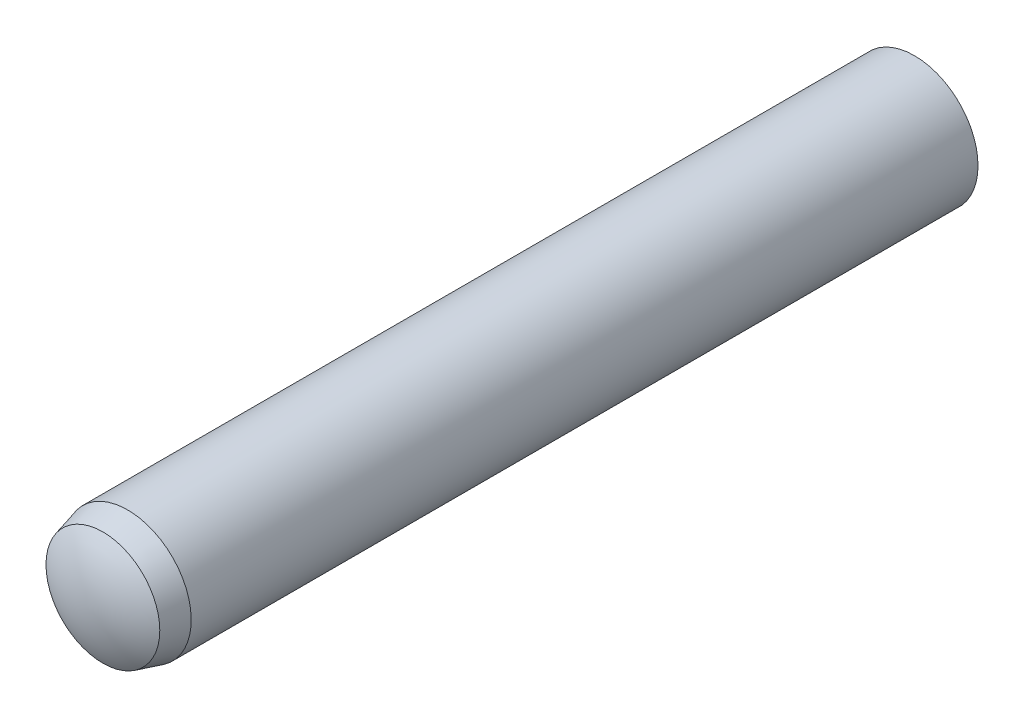
ISO-10303-21;
HEADER;
FILE_DESCRIPTION(('STEP AP214'),'2;1');
FILE_NAME('part.step','',(''),(''),'','','');
FILE_SCHEMA(('AUTOMOTIVE_DESIGN { 1 0 10303 214 1 1 1 1 }'));
ENDSEC;
DATA;
#1=APPLICATION_CONTEXT('core data for automotive mechanical design processes');
#2=APPLICATION_PROTOCOL_DEFINITION('international standard','automotive_design',2000,#1);
#3=PRODUCT_CONTEXT('',#1,'mechanical');
#4=PRODUCT('Part','Part','',(#3));
#5=PRODUCT_RELATED_PRODUCT_CATEGORY('part','',(#4));
#6=PRODUCT_DEFINITION_FORMATION('','',#4);
#7=PRODUCT_DEFINITION_CONTEXT('part definition',#1,'design');
#8=PRODUCT_DEFINITION('design','',#6,#7);
#9=PRODUCT_DEFINITION_SHAPE('','',#8);
#10=(LENGTH_UNIT() NAMED_UNIT(*) SI_UNIT(.MILLI.,.METRE.));
#11=(NAMED_UNIT(*) PLANE_ANGLE_UNIT() SI_UNIT($,.RADIAN.));
#12=(NAMED_UNIT(*) SI_UNIT($,.STERADIAN.) SOLID_ANGLE_UNIT());
#13=UNCERTAINTY_MEASURE_WITH_UNIT(LENGTH_MEASURE(1.E-05),#10,'distance_accuracy_value','');
#14=(GEOMETRIC_REPRESENTATION_CONTEXT(3) GLOBAL_UNCERTAINTY_ASSIGNED_CONTEXT((#13)) GLOBAL_UNIT_ASSIGNED_CONTEXT((#10,
#11,#12)) REPRESENTATION_CONTEXT('',''));
#15=CARTESIAN_POINT('',(0.,0.,0.));
#16=DIRECTION('',(0.,0.,1.));
#17=DIRECTION('',(1.,0.,0.));
#18=AXIS2_PLACEMENT_3D('',#15,#16,#17);
#19=CARTESIAN_POINT('',(0.,0.,-7.27499999999998));
#20=DIRECTION('',(0.,0.,1.));
#21=DIRECTION('',(0.,1.,0.));
#22=AXIS2_PLACEMENT_3D('',#19,#20,#21);
#23=SPHERICAL_SURFACE('',#22,2.72500000000002);
#24=CARTESIAN_POINT('',(0.,0.,-9.55));
#25=DIRECTION('',(0.,0.,1.));
#26=DIRECTION('',(0.,-1.,0.));
#27=AXIS2_PLACEMENT_3D('',#24,#25,#26);
#28=CIRCLE('',#27,1.5);
#29=CARTESIAN_POINT('',(0.,-1.49999999999999,-9.55));
#30=VERTEX_POINT('',#29);
#31=EDGE_CURVE('E10',#30,#30,#28,.T.);
#32=ORIENTED_EDGE('',*,*,#31,.F.);
#33=EDGE_LOOP('',(#32));
#34=FACE_BOUND('',#33,.T.);
#35=ADVANCED_FACE('F37',(#34),#23,.T.);
#36=CARTESIAN_POINT('',(0.,0.,10.));
#37=DIRECTION('',(0.,0.,1.));
#38=DIRECTION('',(0.,-1.,0.));
#39=AXIS2_PLACEMENT_3D('',#36,#37,#38);
#40=CYLINDRICAL_SURFACE('',#39,1.5);
#41=CARTESIAN_POINT('',(0.,0.,9.025));
#42=DIRECTION('',(0.,0.,1.));
#43=DIRECTION('',(0.,-1.,0.));
#44=AXIS2_PLACEMENT_3D('',#41,#42,#43);
#45=CIRCLE('',#44,1.5);
#46=CARTESIAN_POINT('',(0.,-1.5,9.025));
#47=VERTEX_POINT('',#46);
#48=EDGE_CURVE('E43',#47,#47,#45,.T.);
#49=ORIENTED_EDGE('',*,*,#48,.F.);
#50=EDGE_LOOP('',(#49));
#51=FACE_BOUND('',#50,.T.);
#52=ORIENTED_EDGE('',*,*,#31,.T.);
#53=EDGE_LOOP('',(#52));
#54=FACE_BOUND('',#53,.T.);
#55=ADVANCED_FACE('F58',(#51,#54),#40,.T.);
#56=CARTESIAN_POINT('',(0.,0.,9.025));
#57=DIRECTION('',(0.,0.,-1.));
#58=DIRECTION('',(0.,1.,0.));
#59=AXIS2_PLACEMENT_3D('',#56,#57,#58);
#60=CONICAL_SURFACE('',#59,1.5,0.261799387799152);
#61=CARTESIAN_POINT('',(0.,0.,9.61));
#62=DIRECTION('',(0.,0.,1.));
#63=DIRECTION('',(0.,-1.,0.));
#64=AXIS2_PLACEMENT_3D('',#61,#62,#63);
#65=CIRCLE('',#64,1.34324972242779);
#66=CARTESIAN_POINT('',(0.,-1.34324972242779,9.61));
#67=VERTEX_POINT('',#66);
#68=EDGE_CURVE('E47',#67,#67,#65,.T.);
#69=ORIENTED_EDGE('',*,*,#68,.F.);
#70=EDGE_LOOP('',(#69));
#71=FACE_BOUND('',#70,.T.);
#72=ORIENTED_EDGE('',*,*,#48,.T.);
#73=EDGE_LOOP('',(#72));
#74=FACE_BOUND('',#73,.T.);
#75=ADVANCED_FACE('F56',(#71,#74),#60,.T.);
#76=CARTESIAN_POINT('',(0.,0.,7.49176946563802));
#77=DIRECTION('',(0.,0.,1.));
#78=DIRECTION('',(0.,1.,0.));
#79=AXIS2_PLACEMENT_3D('',#76,#77,#78);
#80=SPHERICAL_SURFACE('',#79,2.50823053436198);
#81=ORIENTED_EDGE('',*,*,#68,.T.);
#82=EDGE_LOOP('',(#81));
#83=FACE_BOUND('',#82,.T.);
#84=ADVANCED_FACE('F54',(#83),#80,.T.);
#85=CLOSED_SHELL('',(#35,#55,#75,#84));
#86=MANIFOLD_SOLID_BREP('B2',#85);
#87=ADVANCED_BREP_SHAPE_REPRESENTATION('',(#18,#86),#14);
#88=SHAPE_DEFINITION_REPRESENTATION(#9,#87);
ENDSEC;
END-ISO-10303-21;
